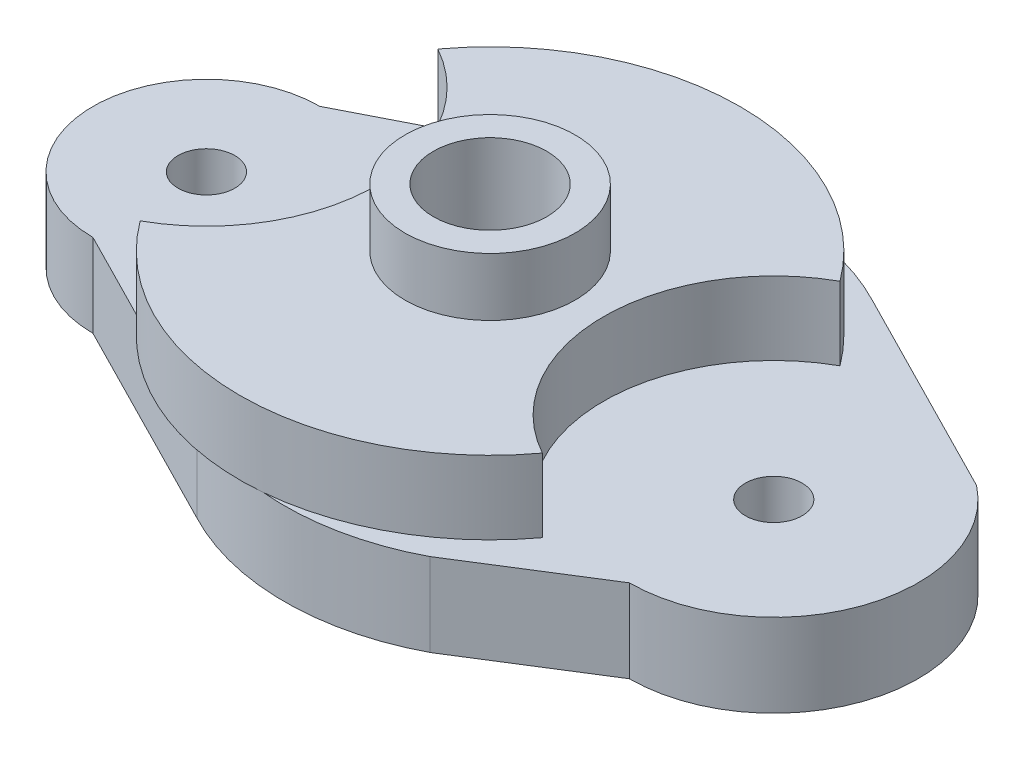
ISO-10303-21;
HEADER;
FILE_DESCRIPTION(('STEP AP214'),'2;1');
FILE_NAME('part.step','',(''),(''),'','','');
FILE_SCHEMA(('AUTOMOTIVE_DESIGN { 1 0 10303 214 1 1 1 1 }'));
ENDSEC;
DATA;
#1=APPLICATION_CONTEXT('core data for automotive mechanical design processes');
#2=APPLICATION_PROTOCOL_DEFINITION('international standard','automotive_design',2000,#1);
#3=PRODUCT_CONTEXT('',#1,'mechanical');
#4=PRODUCT('Part','Part','',(#3));
#5=PRODUCT_RELATED_PRODUCT_CATEGORY('part','',(#4));
#6=PRODUCT_DEFINITION_FORMATION('','',#4);
#7=PRODUCT_DEFINITION_CONTEXT('part definition',#1,'design');
#8=PRODUCT_DEFINITION('design','',#6,#7);
#9=PRODUCT_DEFINITION_SHAPE('','',#8);
#10=(LENGTH_UNIT() NAMED_UNIT(*) SI_UNIT(.MILLI.,.METRE.));
#11=(NAMED_UNIT(*) PLANE_ANGLE_UNIT() SI_UNIT($,.RADIAN.));
#12=(NAMED_UNIT(*) SI_UNIT($,.STERADIAN.) SOLID_ANGLE_UNIT());
#13=UNCERTAINTY_MEASURE_WITH_UNIT(LENGTH_MEASURE(1.E-05),#10,'distance_accuracy_value','');
#14=(GEOMETRIC_REPRESENTATION_CONTEXT(3) GLOBAL_UNCERTAINTY_ASSIGNED_CONTEXT((#13)) GLOBAL_UNIT_ASSIGNED_CONTEXT((#10,
#11,#12)) REPRESENTATION_CONTEXT('',''));
#15=CARTESIAN_POINT('',(0.,0.,0.));
#16=DIRECTION('',(0.,0.,1.));
#17=DIRECTION('',(1.,0.,0.));
#18=AXIS2_PLACEMENT_3D('',#15,#16,#17);
#19=CARTESIAN_POINT('',(0.,8.200009,0.));
#20=DIRECTION('',(0.,-1.,0.));
#21=DIRECTION('',(0.,0.,-1.));
#22=AXIS2_PLACEMENT_3D('',#19,#20,#21);
#23=CYLINDRICAL_SURFACE('',#22,28.);
#24=CARTESIAN_POINT('',(0.,0.,0.));
#25=DIRECTION('',(0.,-1.,0.));
#26=DIRECTION('',(0.,0.,-1.));
#27=AXIS2_PLACEMENT_3D('',#24,#25,#26);
#28=CIRCLE('',#27,28.);
#29=CARTESIAN_POINT('',(-21.5232244645244,0.,-17.9095172645636));
#30=VERTEX_POINT('',#29);
#31=CARTESIAN_POINT('',(-22.5064566929134,0.,-16.6571128089478));
#32=VERTEX_POINT('',#31);
#33=EDGE_CURVE('E141',#30,#32,#28,.F.);
#34=ORIENTED_EDGE('',*,*,#33,.T.);
#35=DIRECTION('',(0.,1.,0.));
#36=VECTOR('',#35,1.);
#37=CARTESIAN_POINT('',(-22.5064566929134,4.1000045,-16.6571128089478));
#38=LINE('',#37,#36);
#39=CARTESIAN_POINT('',(-22.5064566929134,8.200009,-16.6571128089478));
#40=VERTEX_POINT('',#39);
#41=EDGE_CURVE('E11',#32,#40,#38,.T.);
#42=ORIENTED_EDGE('',*,*,#41,.T.);
#43=CARTESIAN_POINT('',(0.,8.200009,0.));
#44=DIRECTION('',(0.,1.,0.));
#45=DIRECTION('',(0.,0.,1.));
#46=AXIS2_PLACEMENT_3D('',#43,#44,#45);
#47=CIRCLE('',#46,28.);
#48=CARTESIAN_POINT('',(22.5064566929134,8.200009,-16.6571128089478));
#49=VERTEX_POINT('',#48);
#50=EDGE_CURVE('E149',#49,#40,#47,.T.);
#51=ORIENTED_EDGE('',*,*,#50,.F.);
#52=DIRECTION('',(0.,1.,0.));
#53=VECTOR('',#52,1.);
#54=CARTESIAN_POINT('',(22.5064566929134,4.1000045,-16.6571128089478));
#55=LINE('',#54,#53);
#56=CARTESIAN_POINT('',(22.5064566929134,0.,-16.6571128089478));
#57=VERTEX_POINT('',#56);
#58=EDGE_CURVE('E133',#49,#57,#55,.F.);
#59=ORIENTED_EDGE('',*,*,#58,.T.);
#60=CARTESIAN_POINT('',(0.,0.,0.));
#61=DIRECTION('',(0.,1.,0.));
#62=DIRECTION('',(0.,0.,1.));
#63=AXIS2_PLACEMENT_3D('',#60,#61,#62);
#64=CIRCLE('',#63,28.);
#65=CARTESIAN_POINT('',(2.5,0.,-27.8881695347687));
#66=VERTEX_POINT('',#65);
#67=EDGE_CURVE('E164',#57,#66,#64,.T.);
#68=ORIENTED_EDGE('',*,*,#67,.T.);
#69=EDGE_CURVE('E165',#66,#30,#64,.T.);
#70=ORIENTED_EDGE('',*,*,#69,.T.);
#71=EDGE_LOOP('',(#34,#42,#51,#59,#68,#70));
#72=FACE_BOUND('',#71,.T.);
#73=ADVANCED_FACE('F32',(#72),#23,.T.);
#74=CARTESIAN_POINT('',(-31.75,0.,0.));
#75=DIRECTION('',(0.,-1.,0.));
#76=DIRECTION('',(0.,0.,-1.));
#77=AXIS2_PLACEMENT_3D('',#74,#75,#76);
#78=PLANE('',#77);
#79=CARTESIAN_POINT('',(-22.5064566929134,0.,16.6571128089478));
#80=VERTEX_POINT('',#79);
#81=CARTESIAN_POINT('',(-21.5232244645244,0.,17.9095172645635));
#82=VERTEX_POINT('',#81);
#83=EDGE_CURVE('E248',#80,#82,#28,.F.);
#84=ORIENTED_EDGE('',*,*,#83,.F.);
#85=CARTESIAN_POINT('',(-31.75,0.,0.));
#86=DIRECTION('',(0.,1.,0.));
#87=DIRECTION('',(0.,0.,1.));
#88=AXIS2_PLACEMENT_3D('',#85,#86,#87);
#89=CIRCLE('',#88,19.05);
#90=EDGE_CURVE('E47',#80,#32,#89,.T.);
#91=ORIENTED_EDGE('',*,*,#90,.T.);
#92=ORIENTED_EDGE('',*,*,#33,.F.);
#93=DIRECTION('',(0.891051813821172,0.,-0.453901602867846));
#94=VECTOR('',#93,1.);
#95=CARTESIAN_POINT('',(-31.75,0.,-12.7));
#96=LINE('',#95,#94);
#97=CARTESIAN_POINT('',(-31.75,0.,-12.7));
#98=VERTEX_POINT('',#97);
#99=EDGE_CURVE('E203',#98,#30,#96,.T.);
#100=ORIENTED_EDGE('',*,*,#99,.F.);
#101=CARTESIAN_POINT('',(-31.75,0.,0.));
#102=DIRECTION('',(0.,-1.,0.));
#103=DIRECTION('',(0.,0.,-1.));
#104=AXIS2_PLACEMENT_3D('',#101,#102,#103);
#105=CIRCLE('',#104,12.7);
#106=CARTESIAN_POINT('',(-31.75,0.,12.7));
#107=VERTEX_POINT('',#106);
#108=EDGE_CURVE('E199',#107,#98,#105,.T.);
#109=ORIENTED_EDGE('',*,*,#108,.F.);
#110=DIRECTION('',(0.891051813821172,0.,0.453901602867846));
#111=VECTOR('',#110,1.);
#112=CARTESIAN_POINT('',(-31.75,0.,12.7));
#113=LINE('',#112,#111);
#114=EDGE_CURVE('E182',#107,#82,#113,.T.);
#115=ORIENTED_EDGE('',*,*,#114,.T.);
#116=EDGE_LOOP('',(#84,#91,#92,#100,#109,#115));
#117=FACE_BOUND('',#116,.T.);
#118=CARTESIAN_POINT('',(-31.75,0.,0.));
#119=DIRECTION('',(0.,1.,0.));
#120=DIRECTION('',(0.,0.,1.));
#121=AXIS2_PLACEMENT_3D('',#118,#119,#120);
#122=CIRCLE('',#121,3.175);
#123=CARTESIAN_POINT('',(-31.75,0.,3.175));
#124=VERTEX_POINT('',#123);
#125=EDGE_CURVE('E166',#124,#124,#122,.T.);
#126=ORIENTED_EDGE('',*,*,#125,.F.);
#127=EDGE_LOOP('',(#126));
#128=FACE_BOUND('',#127,.T.);
#129=ADVANCED_FACE('F259',(#117,#128),#78,.F.);
#130=CARTESIAN_POINT('',(0.,14.699996,0.));
#131=DIRECTION('',(0.,1.,0.));
#132=DIRECTION('',(0.,0.,1.));
#133=AXIS2_PLACEMENT_3D('',#130,#131,#132);
#134=PLANE('',#133);
#135=CARTESIAN_POINT('',(0.,14.699996,0.));
#136=DIRECTION('',(0.,1.,0.));
#137=DIRECTION('',(0.,0.,1.));
#138=AXIS2_PLACEMENT_3D('',#135,#136,#137);
#139=CIRCLE('',#138,9.525);
#140=CARTESIAN_POINT('',(0.,14.699996,9.525));
#141=VERTEX_POINT('',#140);
#142=EDGE_CURVE('E245',#141,#141,#139,.T.);
#143=ORIENTED_EDGE('',*,*,#142,.T.);
#144=EDGE_LOOP('',(#143));
#145=FACE_BOUND('',#144,.T.);
#146=CARTESIAN_POINT('',(0.,14.699996,0.));
#147=DIRECTION('',(0.,1.,0.));
#148=DIRECTION('',(0.,0.,1.));
#149=AXIS2_PLACEMENT_3D('',#146,#147,#148);
#150=CIRCLE('',#149,6.35);
#151=CARTESIAN_POINT('',(0.,14.699996,6.35));
#152=VERTEX_POINT('',#151);
#153=EDGE_CURVE('E242',#152,#152,#150,.T.);
#154=ORIENTED_EDGE('',*,*,#153,.F.);
#155=EDGE_LOOP('',(#154));
#156=FACE_BOUND('',#155,.T.);
#157=ADVANCED_FACE('F329',(#145,#156),#134,.T.);
#158=CARTESIAN_POINT('',(0.,14.699996,0.));
#159=DIRECTION('',(0.,-1.,0.));
#160=DIRECTION('',(0.,0.,-1.));
#161=AXIS2_PLACEMENT_3D('',#158,#159,#160);
#162=CYLINDRICAL_SURFACE('',#161,9.525);
#163=CARTESIAN_POINT('',(0.,8.200009,0.));
#164=DIRECTION('',(0.,1.,0.));
#165=DIRECTION('',(0.,0.,1.));
#166=AXIS2_PLACEMENT_3D('',#163,#164,#165);
#167=CIRCLE('',#166,9.525);
#168=CARTESIAN_POINT('',(0.,8.200009,9.525));
#169=VERTEX_POINT('',#168);
#170=EDGE_CURVE('E154',#169,#169,#167,.T.);
#171=ORIENTED_EDGE('',*,*,#170,.T.);
#172=EDGE_LOOP('',(#171));
#173=FACE_BOUND('',#172,.T.);
#174=ORIENTED_EDGE('',*,*,#142,.F.);
#175=EDGE_LOOP('',(#174));
#176=FACE_BOUND('',#175,.T.);
#177=ADVANCED_FACE('F34',(#173,#176),#162,.T.);
#178=CARTESIAN_POINT('',(0.,14.699996,0.));
#179=DIRECTION('',(0.,-1.,0.));
#180=DIRECTION('',(0.,0.,-1.));
#181=AXIS2_PLACEMENT_3D('',#178,#179,#180);
#182=CYLINDRICAL_SURFACE('',#181,6.35);
#183=ORIENTED_EDGE('',*,*,#153,.T.);
#184=EDGE_LOOP('',(#183));
#185=FACE_BOUND('',#184,.T.);
#186=CARTESIAN_POINT('',(0.,-9.3000068000002,0.));
#187=DIRECTION('',(0.,-1.,0.));
#188=DIRECTION('',(0.,0.,-1.));
#189=AXIS2_PLACEMENT_3D('',#186,#187,#188);
#190=CIRCLE('',#189,6.35);
#191=CARTESIAN_POINT('',(0.,-9.3000068000002,-6.35));
#192=VERTEX_POINT('',#191);
#193=EDGE_CURVE('E177',#192,#192,#190,.T.);
#194=ORIENTED_EDGE('',*,*,#193,.T.);
#195=EDGE_LOOP('',(#194));
#196=FACE_BOUND('',#195,.T.);
#197=ADVANCED_FACE('F408',(#185,#196),#182,.F.);
#198=CARTESIAN_POINT('',(-31.75,-9.3000068,0.));
#199=DIRECTION('',(0.,1.,0.));
#200=DIRECTION('',(0.,0.,1.));
#201=AXIS2_PLACEMENT_3D('',#198,#199,#200);
#202=CYLINDRICAL_SURFACE('',#201,12.7);
#203=ORIENTED_EDGE('',*,*,#108,.T.);
#204=DIRECTION('',(0.,1.,0.));
#205=VECTOR('',#204,1.);
#206=CARTESIAN_POINT('',(-31.75,-9.3000068,-12.7));
#207=LINE('',#206,#205);
#208=CARTESIAN_POINT('',(-31.75,-9.3000068,-12.7));
#209=VERTEX_POINT('',#208);
#210=EDGE_CURVE('E239',#209,#98,#207,.T.);
#211=ORIENTED_EDGE('',*,*,#210,.F.);
#212=CARTESIAN_POINT('',(-31.75,-9.3000068,0.));
#213=DIRECTION('',(0.,-1.,0.));
#214=DIRECTION('',(0.,0.,-1.));
#215=AXIS2_PLACEMENT_3D('',#212,#213,#214);
#216=CIRCLE('',#215,12.7);
#217=CARTESIAN_POINT('',(-31.75,-9.3000068,12.7));
#218=VERTEX_POINT('',#217);
#219=EDGE_CURVE('E178',#218,#209,#216,.T.);
#220=ORIENTED_EDGE('',*,*,#219,.F.);
#221=DIRECTION('',(0.,1.,0.));
#222=VECTOR('',#221,1.);
#223=CARTESIAN_POINT('',(-31.75,-9.3000068,12.7));
#224=LINE('',#223,#222);
#225=EDGE_CURVE('E198',#218,#107,#224,.T.);
#226=ORIENTED_EDGE('',*,*,#225,.T.);
#227=EDGE_LOOP('',(#203,#211,#220,#226));
#228=FACE_BOUND('',#227,.T.);
#229=ADVANCED_FACE('F296',(#228),#202,.T.);
#230=CARTESIAN_POINT('',(-31.75,-9.3000068,-12.7));
#231=DIRECTION('',(0.453901602867846,0.,0.891051813821172));
#232=DIRECTION('',(0.891051813821172,0.,-0.453901602867846));
#233=AXIS2_PLACEMENT_3D('',#230,#231,#232);
#234=PLANE('',#233);
#235=ORIENTED_EDGE('',*,*,#99,.T.);
#236=CARTESIAN_POINT('',(-8.05817034894059,0.,-24.7686129433614));
#237=VERTEX_POINT('',#236);
#238=EDGE_CURVE('E202',#30,#237,#96,.T.);
#239=ORIENTED_EDGE('',*,*,#238,.T.);
#240=DIRECTION('',(0.,1.,0.));
#241=VECTOR('',#240,1.);
#242=CARTESIAN_POINT('',(-8.05817034894059,-9.3000068,-24.7686129433614));
#243=LINE('',#242,#241);
#244=CARTESIAN_POINT('',(-8.05817034894059,-9.3000068,-24.7686129433614));
#245=VERTEX_POINT('',#244);
#246=EDGE_CURVE('E236',#245,#237,#243,.T.);
#247=ORIENTED_EDGE('',*,*,#246,.F.);
#248=DIRECTION('',(0.891051813821172,0.,-0.453901602867846));
#249=VECTOR('',#248,1.);
#250=CARTESIAN_POINT('',(-31.75,-9.3000068,-12.7));
#251=LINE('',#250,#249);
#252=EDGE_CURVE('E181',#209,#245,#251,.T.);
#253=ORIENTED_EDGE('',*,*,#252,.F.);
#254=ORIENTED_EDGE('',*,*,#210,.T.);
#255=EDGE_LOOP('',(#235,#239,#247,#253,#254));
#256=FACE_BOUND('',#255,.T.);
#257=ADVANCED_FACE('F293',(#256),#234,.F.);
#258=CARTESIAN_POINT('',(5.,-9.3000068,0.));
#259=DIRECTION('',(0.,1.,0.));
#260=DIRECTION('',(0.,0.,1.));
#261=AXIS2_PLACEMENT_3D('',#258,#259,#260);
#262=CYLINDRICAL_SURFACE('',#261,28.);
#263=CARTESIAN_POINT('',(5.,0.,0.));
#264=DIRECTION('',(0.,-1.,0.));
#265=DIRECTION('',(0.,0.,-1.));
#266=AXIS2_PLACEMENT_3D('',#263,#264,#265);
#267=CIRCLE('',#266,28.);
#268=EDGE_CURVE('E206',#237,#66,#267,.T.);
#269=ORIENTED_EDGE('',*,*,#268,.T.);
#270=CARTESIAN_POINT('',(18.0581703489406,0.,-24.7686129433614));
#271=VERTEX_POINT('',#270);
#272=EDGE_CURVE('E205',#66,#271,#267,.T.);
#273=ORIENTED_EDGE('',*,*,#272,.T.);
#274=DIRECTION('',(0.,1.,0.));
#275=VECTOR('',#274,1.);
#276=CARTESIAN_POINT('',(18.0581703489406,-9.3000068,-24.7686129433614));
#277=LINE('',#276,#275);
#278=CARTESIAN_POINT('',(18.0581703489406,-9.3000068,-24.7686129433614));
#279=VERTEX_POINT('',#278);
#280=EDGE_CURVE('E233',#279,#271,#277,.T.);
#281=ORIENTED_EDGE('',*,*,#280,.F.);
#282=CARTESIAN_POINT('',(5.,-9.3000068,0.));
#283=DIRECTION('',(0.,-1.,0.));
#284=DIRECTION('',(0.,0.,-1.));
#285=AXIS2_PLACEMENT_3D('',#282,#283,#284);
#286=CIRCLE('',#285,28.);
#287=EDGE_CURVE('E184',#245,#279,#286,.T.);
#288=ORIENTED_EDGE('',*,*,#287,.F.);
#289=ORIENTED_EDGE('',*,*,#246,.T.);
#290=EDGE_LOOP('',(#269,#273,#281,#288,#289));
#291=FACE_BOUND('',#290,.T.);
#292=ADVANCED_FACE('F281',(#291),#262,.T.);
#293=CARTESIAN_POINT('',(41.75,-9.3000068,-12.7));
#294=DIRECTION('',(0.453901602867846,0.,-0.891051813821172));
#295=DIRECTION('',(-0.891051813821172,0.,-0.453901602867846));
#296=AXIS2_PLACEMENT_3D('',#293,#294,#295);
#297=PLANE('',#296);
#298=DIRECTION('',(-0.891051813821172,0.,-0.453901602867846));
#299=VECTOR('',#298,1.);
#300=CARTESIAN_POINT('',(41.75,0.,-12.7));
#301=LINE('',#300,#299);
#302=CARTESIAN_POINT('',(41.75,0.,-12.7));
#303=VERTEX_POINT('',#302);
#304=EDGE_CURVE('E209',#303,#271,#301,.T.);
#305=ORIENTED_EDGE('',*,*,#304,.F.);
#306=DIRECTION('',(0.,1.,0.));
#307=VECTOR('',#306,1.);
#308=CARTESIAN_POINT('',(41.75,-9.3000068,-12.7));
#309=LINE('',#308,#307);
#310=CARTESIAN_POINT('',(41.75,-9.3000068,-12.7));
#311=VERTEX_POINT('',#310);
#312=EDGE_CURVE('E231',#311,#303,#309,.T.);
#313=ORIENTED_EDGE('',*,*,#312,.F.);
#314=DIRECTION('',(-0.891051813821172,0.,-0.453901602867846));
#315=VECTOR('',#314,1.);
#316=CARTESIAN_POINT('',(41.75,-9.3000068,-12.7));
#317=LINE('',#316,#315);
#318=EDGE_CURVE('E186',#311,#279,#317,.T.);
#319=ORIENTED_EDGE('',*,*,#318,.T.);
#320=ORIENTED_EDGE('',*,*,#280,.T.);
#321=EDGE_LOOP('',(#305,#313,#319,#320));
#322=FACE_BOUND('',#321,.T.);
#323=ADVANCED_FACE('F315',(#322),#297,.T.);
#324=CARTESIAN_POINT('',(31.75,-9.3000068,0.));
#325=DIRECTION('',(0.,1.,0.));
#326=DIRECTION('',(0.,0.,1.));
#327=AXIS2_PLACEMENT_3D('',#324,#325,#326);
#328=CYLINDRICAL_SURFACE('',#327,16.1644672043343);
#329=CARTESIAN_POINT('',(31.75,0.,0.));
#330=DIRECTION('',(0.,-1.,0.));
#331=DIRECTION('',(0.,0.,-1.));
#332=AXIS2_PLACEMENT_3D('',#329,#330,#331);
#333=CIRCLE('',#332,16.1644672043343);
#334=CARTESIAN_POINT('',(31.75,0.,16.1644672043343));
#335=VERTEX_POINT('',#334);
#336=EDGE_CURVE('E211',#303,#335,#333,.T.);
#337=ORIENTED_EDGE('',*,*,#336,.T.);
#338=DIRECTION('',(0.,1.,0.));
#339=VECTOR('',#338,1.);
#340=CARTESIAN_POINT('',(31.75,-9.3000068,16.1644672043343));
#341=LINE('',#340,#339);
#342=CARTESIAN_POINT('',(31.75,-9.3000068,16.1644672043343));
#343=VERTEX_POINT('',#342);
#344=EDGE_CURVE('E228',#343,#335,#341,.T.);
#345=ORIENTED_EDGE('',*,*,#344,.F.);
#346=CARTESIAN_POINT('',(31.75,-9.3000068,0.));
#347=DIRECTION('',(0.,-1.,0.));
#348=DIRECTION('',(0.,0.,-1.));
#349=AXIS2_PLACEMENT_3D('',#346,#347,#348);
#350=CIRCLE('',#349,16.1644672043343);
#351=EDGE_CURVE('E189',#311,#343,#350,.T.);
#352=ORIENTED_EDGE('',*,*,#351,.F.);
#353=ORIENTED_EDGE('',*,*,#312,.T.);
#354=EDGE_LOOP('',(#337,#345,#352,#353));
#355=FACE_BOUND('',#354,.T.);
#356=ADVANCED_FACE('F312',(#355),#328,.T.);
#357=CARTESIAN_POINT('',(31.75,-9.3000068,16.1644672043343));
#358=DIRECTION('',(-0.532076365384428,0.,-0.846696369071757));
#359=DIRECTION('',(-0.846696369071757,0.,0.532076365384428));
#360=AXIS2_PLACEMENT_3D('',#357,#358,#359);
#361=PLANE('',#360);
#362=DIRECTION('',(-0.846696369071757,0.,0.532076365384428));
#363=VECTOR('',#362,1.);
#364=CARTESIAN_POINT('',(31.75,0.,16.1644672043343));
#365=LINE('',#364,#363);
#366=CARTESIAN_POINT('',(18.0581703489406,0.,24.7686129433614));
#367=VERTEX_POINT('',#366);
#368=EDGE_CURVE('E213',#335,#367,#365,.T.);
#369=ORIENTED_EDGE('',*,*,#368,.T.);
#370=DIRECTION('',(0.,1.,0.));
#371=VECTOR('',#370,1.);
#372=CARTESIAN_POINT('',(18.0581703489406,-9.3000068,24.7686129433614));
#373=LINE('',#372,#371);
#374=CARTESIAN_POINT('',(18.0581703489406,-9.3000068,24.7686129433614));
#375=VERTEX_POINT('',#374);
#376=EDGE_CURVE('E225',#375,#367,#373,.T.);
#377=ORIENTED_EDGE('',*,*,#376,.F.);
#378=DIRECTION('',(-0.846696369071757,0.,0.532076365384428));
#379=VECTOR('',#378,1.);
#380=CARTESIAN_POINT('',(31.75,-9.3000068,16.1644672043343));
#381=LINE('',#380,#379);
#382=EDGE_CURVE('E191',#343,#375,#381,.T.);
#383=ORIENTED_EDGE('',*,*,#382,.F.);
#384=ORIENTED_EDGE('',*,*,#344,.T.);
#385=EDGE_LOOP('',(#369,#377,#383,#384));
#386=FACE_BOUND('',#385,.T.);
#387=ADVANCED_FACE('F308',(#386),#361,.F.);
#388=CARTESIAN_POINT('',(5.,-9.3000068,0.));
#389=DIRECTION('',(0.,1.,0.));
#390=DIRECTION('',(0.,0.,1.));
#391=AXIS2_PLACEMENT_3D('',#388,#389,#390);
#392=CYLINDRICAL_SURFACE('',#391,28.);
#393=CARTESIAN_POINT('',(5.,0.,0.));
#394=DIRECTION('',(0.,-1.,0.));
#395=DIRECTION('',(0.,0.,-1.));
#396=AXIS2_PLACEMENT_3D('',#393,#394,#395);
#397=CIRCLE('',#396,28.);
#398=CARTESIAN_POINT('',(2.50000000000001,0.,27.8881695347687));
#399=VERTEX_POINT('',#398);
#400=EDGE_CURVE('E216',#367,#399,#397,.T.);
#401=ORIENTED_EDGE('',*,*,#400,.T.);
#402=CARTESIAN_POINT('',(-8.05817034894059,0.,24.7686129433614));
#403=VERTEX_POINT('',#402);
#404=EDGE_CURVE('E215',#399,#403,#397,.T.);
#405=ORIENTED_EDGE('',*,*,#404,.T.);
#406=DIRECTION('',(0.,1.,0.));
#407=VECTOR('',#406,1.);
#408=CARTESIAN_POINT('',(-8.05817034894059,-9.3000068,24.7686129433614));
#409=LINE('',#408,#407);
#410=CARTESIAN_POINT('',(-8.05817034894059,-9.3000068,24.7686129433614));
#411=VERTEX_POINT('',#410);
#412=EDGE_CURVE('E222',#411,#403,#409,.T.);
#413=ORIENTED_EDGE('',*,*,#412,.F.);
#414=CARTESIAN_POINT('',(5.,-9.3000068,0.));
#415=DIRECTION('',(0.,-1.,0.));
#416=DIRECTION('',(0.,0.,-1.));
#417=AXIS2_PLACEMENT_3D('',#414,#415,#416);
#418=CIRCLE('',#417,28.);
#419=EDGE_CURVE('E193',#375,#411,#418,.T.);
#420=ORIENTED_EDGE('',*,*,#419,.F.);
#421=ORIENTED_EDGE('',*,*,#376,.T.);
#422=EDGE_LOOP('',(#401,#405,#413,#420,#421));
#423=FACE_BOUND('',#422,.T.);
#424=ADVANCED_FACE('F304',(#423),#392,.T.);
#425=CARTESIAN_POINT('',(-31.75,-9.3000068,12.7));
#426=DIRECTION('',(-0.453901602867846,0.,0.891051813821172));
#427=DIRECTION('',(0.891051813821172,0.,0.453901602867846));
#428=AXIS2_PLACEMENT_3D('',#425,#426,#427);
#429=PLANE('',#428);
#430=ORIENTED_EDGE('',*,*,#114,.F.);
#431=ORIENTED_EDGE('',*,*,#225,.F.);
#432=DIRECTION('',(0.891051813821172,0.,0.453901602867846));
#433=VECTOR('',#432,1.);
#434=CARTESIAN_POINT('',(-31.75,-9.3000068,12.7));
#435=LINE('',#434,#433);
#436=EDGE_CURVE('E195',#218,#411,#435,.T.);
#437=ORIENTED_EDGE('',*,*,#436,.T.);
#438=ORIENTED_EDGE('',*,*,#412,.T.);
#439=EDGE_CURVE('E219',#82,#403,#113,.T.);
#440=ORIENTED_EDGE('',*,*,#439,.F.);
#441=EDGE_LOOP('',(#430,#431,#437,#438,#440));
#442=FACE_BOUND('',#441,.T.);
#443=ADVANCED_FACE('F264',(#442),#429,.T.);
#444=CARTESIAN_POINT('',(-31.75,-9.3000068,0.));
#445=DIRECTION('',(0.,-1.,0.));
#446=DIRECTION('',(0.,0.,-1.));
#447=AXIS2_PLACEMENT_3D('',#444,#445,#446);
#448=PLANE('',#447);
#449=CARTESIAN_POINT('',(-31.75,-9.3000068000002,0.));
#450=DIRECTION('',(0.,-1.,0.));
#451=DIRECTION('',(0.,0.,-1.));
#452=AXIS2_PLACEMENT_3D('',#449,#450,#451);
#453=CIRCLE('',#452,3.175);
#454=CARTESIAN_POINT('',(-31.75,-9.3000068000002,-3.175));
#455=VERTEX_POINT('',#454);
#456=EDGE_CURVE('E174',#455,#455,#453,.T.);
#457=ORIENTED_EDGE('',*,*,#456,.F.);
#458=EDGE_LOOP('',(#457));
#459=FACE_BOUND('',#458,.T.);
#460=CARTESIAN_POINT('',(31.75,-9.3000068000002,0.));
#461=DIRECTION('',(0.,-1.,0.));
#462=DIRECTION('',(0.,0.,-1.));
#463=AXIS2_PLACEMENT_3D('',#460,#461,#462);
#464=CIRCLE('',#463,3.17499999999888);
#465=CARTESIAN_POINT('',(31.75,-9.3000068000002,-3.17499999999888));
#466=VERTEX_POINT('',#465);
#467=EDGE_CURVE('E169',#466,#466,#464,.T.);
#468=ORIENTED_EDGE('',*,*,#467,.F.);
#469=EDGE_LOOP('',(#468));
#470=FACE_BOUND('',#469,.T.);
#471=ORIENTED_EDGE('',*,*,#193,.F.);
#472=EDGE_LOOP('',(#471));
#473=FACE_BOUND('',#472,.T.);
#474=ORIENTED_EDGE('',*,*,#219,.T.);
#475=ORIENTED_EDGE('',*,*,#252,.T.);
#476=ORIENTED_EDGE('',*,*,#287,.T.);
#477=ORIENTED_EDGE('',*,*,#318,.F.);
#478=ORIENTED_EDGE('',*,*,#351,.T.);
#479=ORIENTED_EDGE('',*,*,#382,.T.);
#480=ORIENTED_EDGE('',*,*,#419,.T.);
#481=ORIENTED_EDGE('',*,*,#436,.F.);
#482=EDGE_LOOP('',(#474,#475,#476,#477,#478,#479,#480,#481));
#483=FACE_BOUND('',#482,.T.);
#484=ADVANCED_FACE('F299',(#459,#470,#473,#483),#448,.T.);
#485=ORIENTED_EDGE('',*,*,#67,.F.);
#486=CARTESIAN_POINT('',(31.75,0.,0.));
#487=DIRECTION('',(0.,1.,0.));
#488=DIRECTION('',(0.,0.,1.));
#489=AXIS2_PLACEMENT_3D('',#486,#487,#488);
#490=CIRCLE('',#489,19.05);
#491=CARTESIAN_POINT('',(22.5064566929134,0.,16.6571128089478));
#492=VERTEX_POINT('',#491);
#493=EDGE_CURVE('E55',#57,#492,#490,.T.);
#494=ORIENTED_EDGE('',*,*,#493,.T.);
#495=EDGE_CURVE('E159',#399,#492,#64,.T.);
#496=ORIENTED_EDGE('',*,*,#495,.F.);
#497=ORIENTED_EDGE('',*,*,#400,.F.);
#498=ORIENTED_EDGE('',*,*,#368,.F.);
#499=ORIENTED_EDGE('',*,*,#336,.F.);
#500=ORIENTED_EDGE('',*,*,#304,.T.);
#501=ORIENTED_EDGE('',*,*,#272,.F.);
#502=EDGE_LOOP('',(#485,#494,#496,#497,#498,#499,#500,#501));
#503=FACE_BOUND('',#502,.T.);
#504=CARTESIAN_POINT('',(31.75,0.,0.));
#505=DIRECTION('',(0.,1.,0.));
#506=DIRECTION('',(0.,0.,1.));
#507=AXIS2_PLACEMENT_3D('',#504,#505,#506);
#508=CIRCLE('',#507,3.17499999999888);
#509=CARTESIAN_POINT('',(31.75,0.,3.17499999999888));
#510=VERTEX_POINT('',#509);
#511=EDGE_CURVE('E157',#510,#510,#508,.T.);
#512=ORIENTED_EDGE('',*,*,#511,.F.);
#513=EDGE_LOOP('',(#512));
#514=FACE_BOUND('',#513,.T.);
#515=ADVANCED_FACE('F287',(#503,#514),#78,.F.);
#516=CARTESIAN_POINT('',(31.75,-2540.,0.));
#517=DIRECTION('',(0.,1.,0.));
#518=DIRECTION('',(0.,0.,1.));
#519=AXIS2_PLACEMENT_3D('',#516,#517,#518);
#520=CYLINDRICAL_SURFACE('',#519,3.17499999999888);
#521=ORIENTED_EDGE('',*,*,#467,.T.);
#522=EDGE_LOOP('',(#521));
#523=FACE_BOUND('',#522,.T.);
#524=ORIENTED_EDGE('',*,*,#511,.T.);
#525=EDGE_LOOP('',(#524));
#526=FACE_BOUND('',#525,.T.);
#527=ADVANCED_FACE('F350',(#523,#526),#520,.F.);
#528=CARTESIAN_POINT('',(-31.75,-2540.,0.));
#529=DIRECTION('',(0.,1.,0.));
#530=DIRECTION('',(0.,0.,1.));
#531=AXIS2_PLACEMENT_3D('',#528,#529,#530);
#532=CYLINDRICAL_SURFACE('',#531,3.175);
#533=ORIENTED_EDGE('',*,*,#456,.T.);
#534=EDGE_LOOP('',(#533));
#535=FACE_BOUND('',#534,.T.);
#536=ORIENTED_EDGE('',*,*,#125,.T.);
#537=EDGE_LOOP('',(#536));
#538=FACE_BOUND('',#537,.T.);
#539=ADVANCED_FACE('F346',(#535,#538),#532,.F.);
#540=CARTESIAN_POINT('',(0.,0.,0.));
#541=DIRECTION('',(0.,1.,0.));
#542=DIRECTION('',(0.,0.,1.));
#543=AXIS2_PLACEMENT_3D('',#540,#541,#542);
#544=PLANE('',#543);
#545=ORIENTED_EDGE('',*,*,#268,.F.);
#546=ORIENTED_EDGE('',*,*,#238,.F.);
#547=ORIENTED_EDGE('',*,*,#69,.F.);
#548=EDGE_LOOP('',(#545,#546,#547));
#549=FACE_BOUND('',#548,.T.);
#550=ADVANCED_FACE('F291',(#549),#544,.F.);
#551=ORIENTED_EDGE('',*,*,#439,.T.);
#552=ORIENTED_EDGE('',*,*,#404,.F.);
#553=EDGE_CURVE('E271',#82,#399,#64,.T.);
#554=ORIENTED_EDGE('',*,*,#553,.F.);
#555=EDGE_LOOP('',(#551,#552,#554));
#556=FACE_BOUND('',#555,.T.);
#557=ADVANCED_FACE('F272',(#556),#544,.F.);
#558=CARTESIAN_POINT('',(0.,8.200009,0.));
#559=DIRECTION('',(0.,1.,0.));
#560=DIRECTION('',(0.,0.,1.));
#561=AXIS2_PLACEMENT_3D('',#558,#559,#560);
#562=PLANE('',#561);
#563=CARTESIAN_POINT('',(-31.75,8.200009,0.));
#564=DIRECTION('',(0.,1.,0.));
#565=DIRECTION('',(0.,0.,1.));
#566=AXIS2_PLACEMENT_3D('',#563,#564,#565);
#567=CIRCLE('',#566,19.05);
#568=CARTESIAN_POINT('',(-22.5064566929134,8.200009,16.6571128089478));
#569=VERTEX_POINT('',#568);
#570=EDGE_CURVE('E274',#569,#40,#567,.T.);
#571=ORIENTED_EDGE('',*,*,#570,.F.);
#572=CARTESIAN_POINT('',(22.5064566929134,8.200009,16.6571128089478));
#573=VERTEX_POINT('',#572);
#574=EDGE_CURVE('E151',#569,#573,#47,.T.);
#575=ORIENTED_EDGE('',*,*,#574,.T.);
#576=CARTESIAN_POINT('',(31.75,8.200009,0.));
#577=DIRECTION('',(0.,1.,0.));
#578=DIRECTION('',(0.,0.,1.));
#579=AXIS2_PLACEMENT_3D('',#576,#577,#578);
#580=CIRCLE('',#579,19.05);
#581=EDGE_CURVE('E136',#49,#573,#580,.T.);
#582=ORIENTED_EDGE('',*,*,#581,.F.);
#583=ORIENTED_EDGE('',*,*,#50,.T.);
#584=EDGE_LOOP('',(#571,#575,#582,#583));
#585=FACE_BOUND('',#584,.T.);
#586=ORIENTED_EDGE('',*,*,#170,.F.);
#587=EDGE_LOOP('',(#586));
#588=FACE_BOUND('',#587,.T.);
#589=ADVANCED_FACE('F147',(#585,#588),#562,.T.);
#590=ORIENTED_EDGE('',*,*,#574,.F.);
#591=DIRECTION('',(0.,1.,0.));
#592=VECTOR('',#591,1.);
#593=CARTESIAN_POINT('',(-22.5064566929134,4.1000045,16.6571128089478));
#594=LINE('',#593,#592);
#595=EDGE_CURVE('E40',#569,#80,#594,.F.);
#596=ORIENTED_EDGE('',*,*,#595,.T.);
#597=ORIENTED_EDGE('',*,*,#83,.T.);
#598=ORIENTED_EDGE('',*,*,#553,.T.);
#599=ORIENTED_EDGE('',*,*,#495,.T.);
#600=DIRECTION('',(0.,1.,0.));
#601=VECTOR('',#600,1.);
#602=CARTESIAN_POINT('',(22.5064566929134,4.1000045,16.6571128089478));
#603=LINE('',#602,#601);
#604=EDGE_CURVE('E140',#492,#573,#603,.T.);
#605=ORIENTED_EDGE('',*,*,#604,.T.);
#606=EDGE_LOOP('',(#590,#596,#597,#598,#599,#605));
#607=FACE_BOUND('',#606,.T.);
#608=ADVANCED_FACE('F255',(#607),#23,.T.);
#609=CARTESIAN_POINT('',(31.75,0.,0.));
#610=DIRECTION('',(0.,1.,0.));
#611=DIRECTION('',(0.,0.,1.));
#612=AXIS2_PLACEMENT_3D('',#609,#610,#611);
#613=CYLINDRICAL_SURFACE('',#612,19.05);
#614=ORIENTED_EDGE('',*,*,#493,.F.);
#615=ORIENTED_EDGE('',*,*,#58,.F.);
#616=ORIENTED_EDGE('',*,*,#581,.T.);
#617=ORIENTED_EDGE('',*,*,#604,.F.);
#618=EDGE_LOOP('',(#614,#615,#616,#617));
#619=FACE_BOUND('',#618,.T.);
#620=ADVANCED_FACE('F135',(#619),#613,.F.);
#621=CARTESIAN_POINT('',(-31.75,0.,0.));
#622=DIRECTION('',(0.,1.,0.));
#623=DIRECTION('',(0.,0.,1.));
#624=AXIS2_PLACEMENT_3D('',#621,#622,#623);
#625=CYLINDRICAL_SURFACE('',#624,19.05);
#626=ORIENTED_EDGE('',*,*,#90,.F.);
#627=ORIENTED_EDGE('',*,*,#595,.F.);
#628=ORIENTED_EDGE('',*,*,#570,.T.);
#629=ORIENTED_EDGE('',*,*,#41,.F.);
#630=EDGE_LOOP('',(#626,#627,#628,#629));
#631=FACE_BOUND('',#630,.T.);
#632=ADVANCED_FACE('F338',(#631),#625,.F.);
#633=CLOSED_SHELL('',(#73,#129,#157,#177,#197,#229,#257,#292,#323,#356,#387,#424,#443,#484,#515,
#527,#539,#550,#557,#589,#608,#620,#632));
#634=MANIFOLD_SOLID_BREP('B2',#633);
#635=ADVANCED_BREP_SHAPE_REPRESENTATION('',(#18,#634),#14);
#636=SHAPE_DEFINITION_REPRESENTATION(#9,#635);
ENDSEC;
END-ISO-10303-21;
